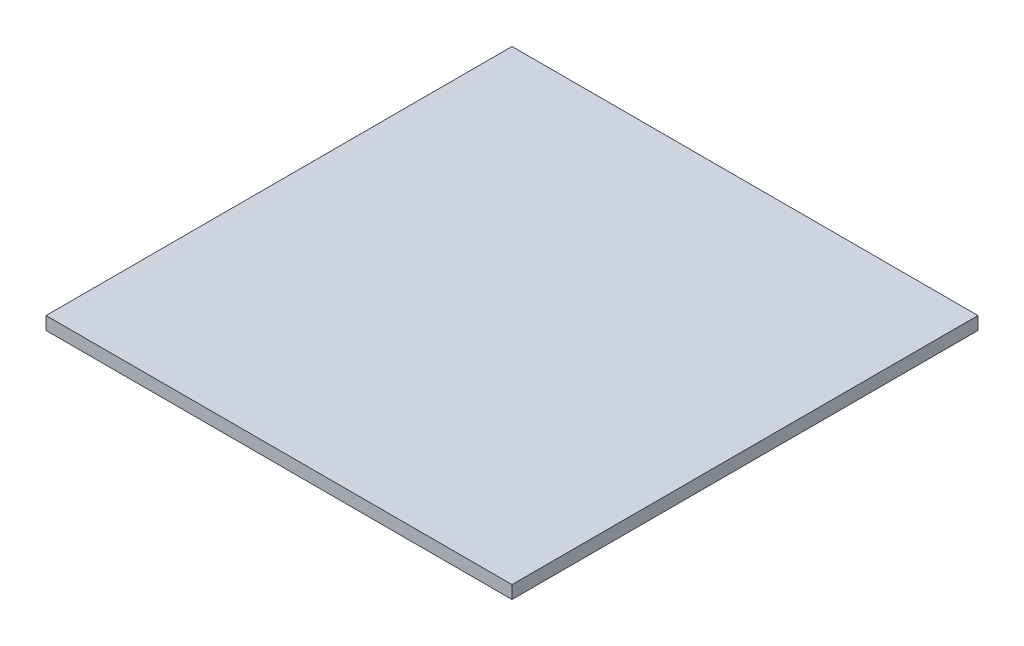
ISO-10303-21;
HEADER;
FILE_DESCRIPTION(('STEP AP214'),'2;1');
FILE_NAME('part.step','',(''),(''),'','','');
FILE_SCHEMA(('AUTOMOTIVE_DESIGN { 1 0 10303 214 1 1 1 1 }'));
ENDSEC;
DATA;
#1=APPLICATION_CONTEXT('core data for automotive mechanical design processes');
#2=APPLICATION_PROTOCOL_DEFINITION('international standard','automotive_design',2000,#1);
#3=PRODUCT_CONTEXT('',#1,'mechanical');
#4=PRODUCT('Part','Part','',(#3));
#5=PRODUCT_RELATED_PRODUCT_CATEGORY('part','',(#4));
#6=PRODUCT_DEFINITION_FORMATION('','',#4);
#7=PRODUCT_DEFINITION_CONTEXT('part definition',#1,'design');
#8=PRODUCT_DEFINITION('design','',#6,#7);
#9=PRODUCT_DEFINITION_SHAPE('','',#8);
#10=(LENGTH_UNIT() NAMED_UNIT(*) SI_UNIT(.MILLI.,.METRE.));
#11=(NAMED_UNIT(*) PLANE_ANGLE_UNIT() SI_UNIT($,.RADIAN.));
#12=(NAMED_UNIT(*) SI_UNIT($,.STERADIAN.) SOLID_ANGLE_UNIT());
#13=UNCERTAINTY_MEASURE_WITH_UNIT(LENGTH_MEASURE(1.E-05),#10,'distance_accuracy_value','');
#14=(GEOMETRIC_REPRESENTATION_CONTEXT(3) GLOBAL_UNCERTAINTY_ASSIGNED_CONTEXT((#13)) GLOBAL_UNIT_ASSIGNED_CONTEXT((#10,
#11,#12)) REPRESENTATION_CONTEXT('',''));
#15=CARTESIAN_POINT('',(0.,0.,0.));
#16=DIRECTION('',(0.,0.,1.));
#17=DIRECTION('',(1.,0.,0.));
#18=AXIS2_PLACEMENT_3D('',#15,#16,#17);
#19=CARTESIAN_POINT('',(180.,10.,-180.));
#20=DIRECTION('',(-1.,0.,0.));
#21=DIRECTION('',(0.,0.,1.));
#22=AXIS2_PLACEMENT_3D('',#19,#20,#21);
#23=PLANE('',#22);
#24=DIRECTION('',(0.,0.,-1.));
#25=VECTOR('',#24,1.);
#26=CARTESIAN_POINT('',(180.,0.,-180.));
#27=LINE('',#26,#25);
#28=CARTESIAN_POINT('',(180.,0.,180.));
#29=VERTEX_POINT('',#28);
#30=CARTESIAN_POINT('',(180.,0.,-180.));
#31=VERTEX_POINT('',#30);
#32=EDGE_CURVE('E100',#29,#31,#27,.T.);
#33=ORIENTED_EDGE('',*,*,#32,.T.);
#34=DIRECTION('',(0.,-1.,0.));
#35=VECTOR('',#34,1.);
#36=CARTESIAN_POINT('',(180.,10.,-180.));
#37=LINE('',#36,#35);
#38=CARTESIAN_POINT('',(180.,10.,-180.));
#39=VERTEX_POINT('',#38);
#40=EDGE_CURVE('E11',#39,#31,#37,.T.);
#41=ORIENTED_EDGE('',*,*,#40,.F.);
#42=DIRECTION('',(0.,0.,-1.));
#43=VECTOR('',#42,1.);
#44=CARTESIAN_POINT('',(180.,10.,-180.));
#45=LINE('',#44,#43);
#46=CARTESIAN_POINT('',(180.,10.,180.));
#47=VERTEX_POINT('',#46);
#48=EDGE_CURVE('E88',#47,#39,#45,.T.);
#49=ORIENTED_EDGE('',*,*,#48,.F.);
#50=DIRECTION('',(0.,-1.,0.));
#51=VECTOR('',#50,1.);
#52=CARTESIAN_POINT('',(180.,10.,180.));
#53=LINE('',#52,#51);
#54=EDGE_CURVE('E96',#47,#29,#53,.T.);
#55=ORIENTED_EDGE('',*,*,#54,.T.);
#56=EDGE_LOOP('',(#33,#41,#49,#55));
#57=FACE_BOUND('',#56,.T.);
#58=ADVANCED_FACE('F37',(#57),#23,.F.);
#59=CARTESIAN_POINT('',(-180.,10.,-180.));
#60=DIRECTION('',(0.,0.,1.));
#61=DIRECTION('',(1.,0.,0.));
#62=AXIS2_PLACEMENT_3D('',#59,#60,#61);
#63=PLANE('',#62);
#64=DIRECTION('',(-1.,0.,0.));
#65=VECTOR('',#64,1.);
#66=CARTESIAN_POINT('',(-180.,0.,-180.));
#67=LINE('',#66,#65);
#68=CARTESIAN_POINT('',(-180.,0.,-180.));
#69=VERTEX_POINT('',#68);
#70=EDGE_CURVE('E92',#31,#69,#67,.T.);
#71=ORIENTED_EDGE('',*,*,#70,.T.);
#72=DIRECTION('',(0.,-1.,0.));
#73=VECTOR('',#72,1.);
#74=CARTESIAN_POINT('',(-180.,10.,-180.));
#75=LINE('',#74,#73);
#76=CARTESIAN_POINT('',(-180.,10.,-180.));
#77=VERTEX_POINT('',#76);
#78=EDGE_CURVE('E45',#77,#69,#75,.T.);
#79=ORIENTED_EDGE('',*,*,#78,.F.);
#80=DIRECTION('',(-1.,0.,0.));
#81=VECTOR('',#80,1.);
#82=CARTESIAN_POINT('',(-180.,10.,-180.));
#83=LINE('',#82,#81);
#84=EDGE_CURVE('E83',#39,#77,#83,.T.);
#85=ORIENTED_EDGE('',*,*,#84,.F.);
#86=ORIENTED_EDGE('',*,*,#40,.T.);
#87=EDGE_LOOP('',(#71,#79,#85,#86));
#88=FACE_BOUND('',#87,.T.);
#89=ADVANCED_FACE('F91',(#88),#63,.F.);
#90=CARTESIAN_POINT('',(-180.,10.,-180.));
#91=DIRECTION('',(1.,0.,0.));
#92=DIRECTION('',(0.,0.,-1.));
#93=AXIS2_PLACEMENT_3D('',#90,#91,#92);
#94=PLANE('',#93);
#95=DIRECTION('',(0.,0.,1.));
#96=VECTOR('',#95,1.);
#97=CARTESIAN_POINT('',(-180.,0.,-180.));
#98=LINE('',#97,#96);
#99=CARTESIAN_POINT('',(-180.,0.,180.));
#100=VERTEX_POINT('',#99);
#101=EDGE_CURVE('E70',#69,#100,#98,.T.);
#102=ORIENTED_EDGE('',*,*,#101,.T.);
#103=DIRECTION('',(0.,-1.,0.));
#104=VECTOR('',#103,1.);
#105=CARTESIAN_POINT('',(-180.,10.,180.));
#106=LINE('',#105,#104);
#107=CARTESIAN_POINT('',(-180.,10.,180.));
#108=VERTEX_POINT('',#107);
#109=EDGE_CURVE('E93',#108,#100,#106,.T.);
#110=ORIENTED_EDGE('',*,*,#109,.F.);
#111=DIRECTION('',(0.,0.,1.));
#112=VECTOR('',#111,1.);
#113=CARTESIAN_POINT('',(-180.,10.,-180.));
#114=LINE('',#113,#112);
#115=EDGE_CURVE('E86',#77,#108,#114,.T.);
#116=ORIENTED_EDGE('',*,*,#115,.F.);
#117=ORIENTED_EDGE('',*,*,#78,.T.);
#118=EDGE_LOOP('',(#102,#110,#116,#117));
#119=FACE_BOUND('',#118,.T.);
#120=ADVANCED_FACE('F94',(#119),#94,.F.);
#121=CARTESIAN_POINT('',(-180.,10.,180.));
#122=DIRECTION('',(0.,0.,-1.));
#123=DIRECTION('',(-1.,0.,0.));
#124=AXIS2_PLACEMENT_3D('',#121,#122,#123);
#125=PLANE('',#124);
#126=DIRECTION('',(1.,0.,0.));
#127=VECTOR('',#126,1.);
#128=CARTESIAN_POINT('',(-180.,0.,180.));
#129=LINE('',#128,#127);
#130=EDGE_CURVE('E76',#100,#29,#129,.T.);
#131=ORIENTED_EDGE('',*,*,#130,.T.);
#132=ORIENTED_EDGE('',*,*,#54,.F.);
#133=DIRECTION('',(1.,0.,0.));
#134=VECTOR('',#133,1.);
#135=CARTESIAN_POINT('',(-180.,10.,180.));
#136=LINE('',#135,#134);
#137=EDGE_CURVE('E53',#108,#47,#136,.T.);
#138=ORIENTED_EDGE('',*,*,#137,.F.);
#139=ORIENTED_EDGE('',*,*,#109,.T.);
#140=EDGE_LOOP('',(#131,#132,#138,#139));
#141=FACE_BOUND('',#140,.T.);
#142=ADVANCED_FACE('F107',(#141),#125,.F.);
#143=CARTESIAN_POINT('',(0.,10.,0.));
#144=DIRECTION('',(0.,1.,0.));
#145=DIRECTION('',(0.,0.,1.));
#146=AXIS2_PLACEMENT_3D('',#143,#144,#145);
#147=PLANE('',#146);
#148=ORIENTED_EDGE('',*,*,#48,.T.);
#149=ORIENTED_EDGE('',*,*,#84,.T.);
#150=ORIENTED_EDGE('',*,*,#115,.T.);
#151=ORIENTED_EDGE('',*,*,#137,.T.);
#152=EDGE_LOOP('',(#148,#149,#150,#151));
#153=FACE_BOUND('',#152,.T.);
#154=ADVANCED_FACE('F84',(#153),#147,.T.);
#155=CARTESIAN_POINT('',(0.,0.,0.));
#156=DIRECTION('',(0.,1.,0.));
#157=DIRECTION('',(0.,0.,1.));
#158=AXIS2_PLACEMENT_3D('',#155,#156,#157);
#159=PLANE('',#158);
#160=ORIENTED_EDGE('',*,*,#32,.F.);
#161=ORIENTED_EDGE('',*,*,#130,.F.);
#162=ORIENTED_EDGE('',*,*,#101,.F.);
#163=ORIENTED_EDGE('',*,*,#70,.F.);
#164=EDGE_LOOP('',(#160,#161,#162,#163));
#165=FACE_BOUND('',#164,.T.);
#166=ADVANCED_FACE('F110',(#165),#159,.F.);
#167=CLOSED_SHELL('',(#58,#89,#120,#142,#154,#166));
#168=MANIFOLD_SOLID_BREP('B2',#167);
#169=ADVANCED_BREP_SHAPE_REPRESENTATION('',(#18,#168),#14);
#170=SHAPE_DEFINITION_REPRESENTATION(#9,#169);
ENDSEC;
END-ISO-10303-21;
